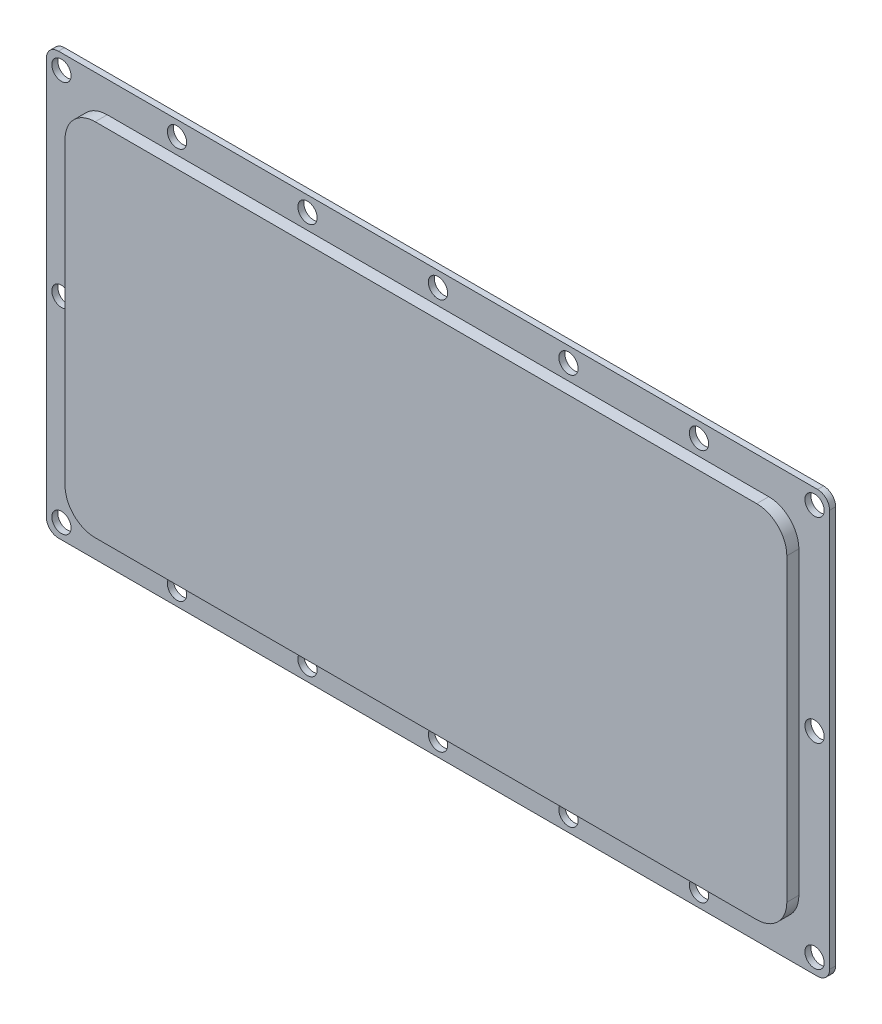
ISO-10303-21;
HEADER;
FILE_DESCRIPTION(('STEP AP214'),'2;1');
FILE_NAME('part.step','',(''),(''),'','','');
FILE_SCHEMA(('AUTOMOTIVE_DESIGN { 1 0 10303 214 1 1 1 1 }'));
ENDSEC;
DATA;
#1=APPLICATION_CONTEXT('core data for automotive mechanical design processes');
#2=APPLICATION_PROTOCOL_DEFINITION('international standard','automotive_design',2000,#1);
#3=PRODUCT_CONTEXT('',#1,'mechanical');
#4=PRODUCT('Part','Part','',(#3));
#5=PRODUCT_RELATED_PRODUCT_CATEGORY('part','',(#4));
#6=PRODUCT_DEFINITION_FORMATION('','',#4);
#7=PRODUCT_DEFINITION_CONTEXT('part definition',#1,'design');
#8=PRODUCT_DEFINITION('design','',#6,#7);
#9=PRODUCT_DEFINITION_SHAPE('','',#8);
#10=(LENGTH_UNIT() NAMED_UNIT(*) SI_UNIT(.MILLI.,.METRE.));
#11=(NAMED_UNIT(*) PLANE_ANGLE_UNIT() SI_UNIT($,.RADIAN.));
#12=(NAMED_UNIT(*) SI_UNIT($,.STERADIAN.) SOLID_ANGLE_UNIT());
#13=UNCERTAINTY_MEASURE_WITH_UNIT(LENGTH_MEASURE(1.E-05),#10,'distance_accuracy_value','');
#14=(GEOMETRIC_REPRESENTATION_CONTEXT(3) GLOBAL_UNCERTAINTY_ASSIGNED_CONTEXT((#13)) GLOBAL_UNIT_ASSIGNED_CONTEXT((#10,
#11,#12)) REPRESENTATION_CONTEXT('',''));
#15=CARTESIAN_POINT('',(0.,0.,0.));
#16=DIRECTION('',(0.,0.,1.));
#17=DIRECTION('',(1.,0.,0.));
#18=AXIS2_PLACEMENT_3D('',#15,#16,#17);
#19=CARTESIAN_POINT('',(2.,2.,1.));
#20=DIRECTION('',(0.,0.,-1.));
#21=DIRECTION('',(-1.,0.,0.));
#22=AXIS2_PLACEMENT_3D('',#19,#20,#21);
#23=PLANE('',#22);
#24=CARTESIAN_POINT('',(21.68,67.5,1.));
#25=DIRECTION('',(0.,0.,-1.));
#26=DIRECTION('',(-1.,0.,0.));
#27=AXIS2_PLACEMENT_3D('',#24,#25,#26);
#28=CIRCLE('',#27,1.6);
#29=CARTESIAN_POINT('',(20.08,67.5,1.));
#30=VERTEX_POINT('',#29);
#31=EDGE_CURVE('E598',#30,#30,#28,.F.);
#32=ORIENTED_EDGE('',*,*,#31,.F.);
#33=EDGE_LOOP('',(#32));
#34=FACE_BOUND('',#33,.T.);
#35=CARTESIAN_POINT('',(2.5,67.5,1.));
#36=DIRECTION('',(0.,0.,-1.));
#37=DIRECTION('',(-1.,0.,0.));
#38=AXIS2_PLACEMENT_3D('',#35,#36,#37);
#39=CIRCLE('',#38,1.6);
#40=CARTESIAN_POINT('',(0.900000000000001,67.5,1.));
#41=VERTEX_POINT('',#40);
#42=EDGE_CURVE('E604',#41,#41,#39,.F.);
#43=ORIENTED_EDGE('',*,*,#42,.F.);
#44=EDGE_LOOP('',(#43));
#45=FACE_BOUND('',#44,.T.);
#46=CARTESIAN_POINT('',(2.49999999999999,2.5,1.));
#47=DIRECTION('',(0.,0.,-1.));
#48=DIRECTION('',(-1.,0.,0.));
#49=AXIS2_PLACEMENT_3D('',#46,#47,#48);
#50=CIRCLE('',#49,1.6);
#51=CARTESIAN_POINT('',(0.899999999999992,2.5,1.));
#52=VERTEX_POINT('',#51);
#53=EDGE_CURVE('E611',#52,#52,#50,.F.);
#54=ORIENTED_EDGE('',*,*,#53,.F.);
#55=EDGE_LOOP('',(#54));
#56=FACE_BOUND('',#55,.T.);
#57=CARTESIAN_POINT('',(21.68,2.5,1.));
#58=DIRECTION('',(0.,0.,-1.));
#59=DIRECTION('',(-1.,0.,0.));
#60=AXIS2_PLACEMENT_3D('',#57,#58,#59);
#61=CIRCLE('',#60,1.6);
#62=CARTESIAN_POINT('',(20.08,2.5,1.));
#63=VERTEX_POINT('',#62);
#64=EDGE_CURVE('E617',#63,#63,#61,.F.);
#65=ORIENTED_EDGE('',*,*,#64,.F.);
#66=EDGE_LOOP('',(#65));
#67=FACE_BOUND('',#66,.T.);
#68=CARTESIAN_POINT('',(86.66,2.49999999999999,1.));
#69=DIRECTION('',(0.,0.,-1.));
#70=DIRECTION('',(-1.,0.,0.));
#71=AXIS2_PLACEMENT_3D('',#68,#69,#70);
#72=CIRCLE('',#71,1.60000000000001);
#73=CARTESIAN_POINT('',(85.06,2.49999999999999,1.));
#74=VERTEX_POINT('',#73);
#75=EDGE_CURVE('E630',#74,#74,#72,.F.);
#76=ORIENTED_EDGE('',*,*,#75,.F.);
#77=EDGE_LOOP('',(#76));
#78=FACE_BOUND('',#77,.T.);
#79=CARTESIAN_POINT('',(65.,2.49999999999999,1.));
#80=DIRECTION('',(0.,0.,-1.));
#81=DIRECTION('',(-1.,0.,0.));
#82=AXIS2_PLACEMENT_3D('',#79,#80,#81);
#83=CIRCLE('',#82,1.60000000000001);
#84=CARTESIAN_POINT('',(63.4,2.49999999999999,1.));
#85=VERTEX_POINT('',#84);
#86=EDGE_CURVE('E629',#85,#85,#83,.F.);
#87=ORIENTED_EDGE('',*,*,#86,.F.);
#88=EDGE_LOOP('',(#87));
#89=FACE_BOUND('',#88,.T.);
#90=CARTESIAN_POINT('',(43.34,2.5,1.));
#91=DIRECTION('',(0.,0.,-1.));
#92=DIRECTION('',(-1.,0.,0.));
#93=AXIS2_PLACEMENT_3D('',#90,#91,#92);
#94=CIRCLE('',#93,1.6);
#95=CARTESIAN_POINT('',(41.74,2.5,1.));
#96=VERTEX_POINT('',#95);
#97=EDGE_CURVE('E643',#96,#96,#94,.F.);
#98=ORIENTED_EDGE('',*,*,#97,.F.);
#99=EDGE_LOOP('',(#98));
#100=FACE_BOUND('',#99,.T.);
#101=CARTESIAN_POINT('',(65.,67.5,1.));
#102=DIRECTION('',(0.,0.,-1.));
#103=DIRECTION('',(-1.,0.,0.));
#104=AXIS2_PLACEMENT_3D('',#101,#102,#103);
#105=CIRCLE('',#104,1.60000000000001);
#106=CARTESIAN_POINT('',(63.4,67.5,1.));
#107=VERTEX_POINT('',#106);
#108=EDGE_CURVE('E623',#107,#107,#105,.F.);
#109=ORIENTED_EDGE('',*,*,#108,.F.);
#110=EDGE_LOOP('',(#109));
#111=FACE_BOUND('',#110,.T.);
#112=CARTESIAN_POINT('',(127.5,35.,1.));
#113=DIRECTION('',(0.,0.,-1.));
#114=DIRECTION('',(-1.,0.,0.));
#115=AXIS2_PLACEMENT_3D('',#112,#113,#114);
#116=CIRCLE('',#115,1.59999999999999);
#117=CARTESIAN_POINT('',(125.9,35.,1.));
#118=VERTEX_POINT('',#117);
#119=EDGE_CURVE('E715',#118,#118,#116,.F.);
#120=ORIENTED_EDGE('',*,*,#119,.F.);
#121=EDGE_LOOP('',(#120));
#122=FACE_BOUND('',#121,.T.);
#123=CARTESIAN_POINT('',(2.5,35.,1.));
#124=DIRECTION('',(0.,0.,-1.));
#125=DIRECTION('',(-1.,0.,0.));
#126=AXIS2_PLACEMENT_3D('',#123,#124,#125);
#127=CIRCLE('',#126,1.6);
#128=CARTESIAN_POINT('',(0.899999999999998,35.,1.));
#129=VERTEX_POINT('',#128);
#130=EDGE_CURVE('E719',#129,#129,#127,.F.);
#131=ORIENTED_EDGE('',*,*,#130,.F.);
#132=EDGE_LOOP('',(#131));
#133=FACE_BOUND('',#132,.T.);
#134=CARTESIAN_POINT('',(86.66,67.5,1.));
#135=DIRECTION('',(0.,0.,-1.));
#136=DIRECTION('',(-1.,0.,0.));
#137=AXIS2_PLACEMENT_3D('',#134,#135,#136);
#138=CIRCLE('',#137,1.60000000000001);
#139=CARTESIAN_POINT('',(85.06,67.5,1.));
#140=VERTEX_POINT('',#139);
#141=EDGE_CURVE('E723',#140,#140,#138,.F.);
#142=ORIENTED_EDGE('',*,*,#141,.F.);
#143=EDGE_LOOP('',(#142));
#144=FACE_BOUND('',#143,.T.);
#145=CARTESIAN_POINT('',(108.32,67.5,1.));
#146=DIRECTION('',(0.,0.,-1.));
#147=DIRECTION('',(-1.,0.,0.));
#148=AXIS2_PLACEMENT_3D('',#145,#146,#147);
#149=CIRCLE('',#148,1.60000000000001);
#150=CARTESIAN_POINT('',(106.72,67.5,1.));
#151=VERTEX_POINT('',#150);
#152=EDGE_CURVE('E727',#151,#151,#149,.F.);
#153=ORIENTED_EDGE('',*,*,#152,.F.);
#154=EDGE_LOOP('',(#153));
#155=FACE_BOUND('',#154,.T.);
#156=CARTESIAN_POINT('',(127.5,67.5,1.));
#157=DIRECTION('',(0.,0.,-1.));
#158=DIRECTION('',(-1.,0.,0.));
#159=AXIS2_PLACEMENT_3D('',#156,#157,#158);
#160=CIRCLE('',#159,1.59999999999999);
#161=CARTESIAN_POINT('',(125.9,67.5,1.));
#162=VERTEX_POINT('',#161);
#163=EDGE_CURVE('E731',#162,#162,#160,.F.);
#164=ORIENTED_EDGE('',*,*,#163,.F.);
#165=EDGE_LOOP('',(#164));
#166=FACE_BOUND('',#165,.T.);
#167=CARTESIAN_POINT('',(127.5,2.49999999999998,1.));
#168=DIRECTION('',(0.,0.,-1.));
#169=DIRECTION('',(-1.,0.,0.));
#170=AXIS2_PLACEMENT_3D('',#167,#168,#169);
#171=CIRCLE('',#170,1.59999999999999);
#172=CARTESIAN_POINT('',(125.9,2.49999999999998,1.));
#173=VERTEX_POINT('',#172);
#174=EDGE_CURVE('E735',#173,#173,#171,.F.);
#175=ORIENTED_EDGE('',*,*,#174,.F.);
#176=EDGE_LOOP('',(#175));
#177=FACE_BOUND('',#176,.T.);
#178=CARTESIAN_POINT('',(108.32,2.49999999999999,1.));
#179=DIRECTION('',(0.,0.,-1.));
#180=DIRECTION('',(-1.,0.,0.));
#181=AXIS2_PLACEMENT_3D('',#178,#179,#180);
#182=CIRCLE('',#181,1.60000000000001);
#183=CARTESIAN_POINT('',(106.72,2.49999999999999,1.));
#184=VERTEX_POINT('',#183);
#185=EDGE_CURVE('E637',#184,#184,#182,.F.);
#186=ORIENTED_EDGE('',*,*,#185,.F.);
#187=EDGE_LOOP('',(#186));
#188=FACE_BOUND('',#187,.T.);
#189=CARTESIAN_POINT('',(43.34,67.5,1.));
#190=DIRECTION('',(0.,0.,-1.));
#191=DIRECTION('',(-1.,0.,0.));
#192=AXIS2_PLACEMENT_3D('',#189,#190,#191);
#193=CIRCLE('',#192,1.6);
#194=CARTESIAN_POINT('',(41.74,67.5,1.));
#195=VERTEX_POINT('',#194);
#196=EDGE_CURVE('E602',#195,#195,#193,.F.);
#197=ORIENTED_EDGE('',*,*,#196,.F.);
#198=EDGE_LOOP('',(#197));
#199=FACE_BOUND('',#198,.T.);
#200=CARTESIAN_POINT('',(2.,2.,1.));
#201=DIRECTION('',(0.,0.,1.));
#202=DIRECTION('',(-1.,0.,0.));
#203=AXIS2_PLACEMENT_3D('',#200,#201,#202);
#204=CIRCLE('',#203,2.);
#205=CARTESIAN_POINT('',(0.,2.00000000000001,1.));
#206=VERTEX_POINT('',#205);
#207=CARTESIAN_POINT('',(2.00000000000001,0.,1.));
#208=VERTEX_POINT('',#207);
#209=EDGE_CURVE('E179',#206,#208,#204,.T.);
#210=ORIENTED_EDGE('',*,*,#209,.T.);
#211=DIRECTION('',(1.,0.,0.));
#212=VECTOR('',#211,1.);
#213=CARTESIAN_POINT('',(2.00000000000001,0.,1.));
#214=LINE('',#213,#212);
#215=CARTESIAN_POINT('',(128.,0.,1.));
#216=VERTEX_POINT('',#215);
#217=EDGE_CURVE('E182',#208,#216,#214,.T.);
#218=ORIENTED_EDGE('',*,*,#217,.T.);
#219=CARTESIAN_POINT('',(128.,2.,1.));
#220=DIRECTION('',(0.,0.,1.));
#221=DIRECTION('',(1.,0.,0.));
#222=AXIS2_PLACEMENT_3D('',#219,#220,#221);
#223=CIRCLE('',#222,2.);
#224=CARTESIAN_POINT('',(130.,2.,1.));
#225=VERTEX_POINT('',#224);
#226=EDGE_CURVE('E185',#216,#225,#223,.T.);
#227=ORIENTED_EDGE('',*,*,#226,.T.);
#228=DIRECTION('',(0.,1.,0.));
#229=VECTOR('',#228,1.);
#230=CARTESIAN_POINT('',(130.,2.00000000000001,1.));
#231=LINE('',#230,#229);
#232=CARTESIAN_POINT('',(130.,68.,1.));
#233=VERTEX_POINT('',#232);
#234=EDGE_CURVE('E187',#225,#233,#231,.T.);
#235=ORIENTED_EDGE('',*,*,#234,.T.);
#236=CARTESIAN_POINT('',(128.,68.,1.));
#237=DIRECTION('',(0.,0.,1.));
#238=DIRECTION('',(-1.,0.,0.));
#239=AXIS2_PLACEMENT_3D('',#236,#237,#238);
#240=CIRCLE('',#239,2.);
#241=CARTESIAN_POINT('',(128.,70.,1.));
#242=VERTEX_POINT('',#241);
#243=EDGE_CURVE('E189',#233,#242,#240,.T.);
#244=ORIENTED_EDGE('',*,*,#243,.T.);
#245=DIRECTION('',(-1.,0.,0.));
#246=VECTOR('',#245,1.);
#247=CARTESIAN_POINT('',(2.00000000000001,70.,1.));
#248=LINE('',#247,#246);
#249=CARTESIAN_POINT('',(2.00000000000001,70.,1.));
#250=VERTEX_POINT('',#249);
#251=EDGE_CURVE('E191',#242,#250,#248,.T.);
#252=ORIENTED_EDGE('',*,*,#251,.T.);
#253=CARTESIAN_POINT('',(2.,68.,1.));
#254=DIRECTION('',(0.,0.,1.));
#255=DIRECTION('',(-1.,0.,0.));
#256=AXIS2_PLACEMENT_3D('',#253,#254,#255);
#257=CIRCLE('',#256,2.);
#258=CARTESIAN_POINT('',(0.,68.,1.));
#259=VERTEX_POINT('',#258);
#260=EDGE_CURVE('E193',#250,#259,#257,.T.);
#261=ORIENTED_EDGE('',*,*,#260,.T.);
#262=DIRECTION('',(0.,-1.,0.));
#263=VECTOR('',#262,1.);
#264=CARTESIAN_POINT('',(0.,2.00000000000001,1.));
#265=LINE('',#264,#263);
#266=EDGE_CURVE('E195',#259,#206,#265,.T.);
#267=ORIENTED_EDGE('',*,*,#266,.T.);
#268=EDGE_LOOP('',(#210,#218,#227,#235,#244,#252,#261,#267));
#269=FACE_BOUND('',#268,.T.);
#270=CARTESIAN_POINT('',(119.9,59.9,1.));
#271=DIRECTION('',(0.,0.,1.));
#272=DIRECTION('',(-1.,0.,0.));
#273=AXIS2_PLACEMENT_3D('',#270,#271,#272);
#274=CIRCLE('',#273,5.);
#275=CARTESIAN_POINT('',(124.9,59.9,1.));
#276=VERTEX_POINT('',#275);
#277=CARTESIAN_POINT('',(119.9,64.9,1.));
#278=VERTEX_POINT('',#277);
#279=EDGE_CURVE('E52',#276,#278,#274,.T.);
#280=ORIENTED_EDGE('',*,*,#279,.F.);
#281=DIRECTION('',(0.,1.,0.));
#282=VECTOR('',#281,1.);
#283=CARTESIAN_POINT('',(124.9,59.9,1.));
#284=LINE('',#283,#282);
#285=CARTESIAN_POINT('',(124.9,10.1,1.));
#286=VERTEX_POINT('',#285);
#287=EDGE_CURVE('E56',#286,#276,#284,.T.);
#288=ORIENTED_EDGE('',*,*,#287,.F.);
#289=CARTESIAN_POINT('',(119.9,10.1,1.));
#290=DIRECTION('',(0.,0.,1.));
#291=DIRECTION('',(1.,0.,0.));
#292=AXIS2_PLACEMENT_3D('',#289,#290,#291);
#293=CIRCLE('',#292,5.);
#294=CARTESIAN_POINT('',(119.9,5.1,1.));
#295=VERTEX_POINT('',#294);
#296=EDGE_CURVE('E678',#295,#286,#293,.T.);
#297=ORIENTED_EDGE('',*,*,#296,.F.);
#298=DIRECTION('',(1.,0.,0.));
#299=VECTOR('',#298,1.);
#300=CARTESIAN_POINT('',(10.1,5.1,1.));
#301=LINE('',#300,#299);
#302=CARTESIAN_POINT('',(10.1,5.1,1.));
#303=VERTEX_POINT('',#302);
#304=EDGE_CURVE('E675',#303,#295,#301,.T.);
#305=ORIENTED_EDGE('',*,*,#304,.F.);
#306=CARTESIAN_POINT('',(10.1,10.1,1.));
#307=DIRECTION('',(0.,0.,1.));
#308=DIRECTION('',(1.,0.,0.));
#309=AXIS2_PLACEMENT_3D('',#306,#307,#308);
#310=CIRCLE('',#309,5.);
#311=CARTESIAN_POINT('',(5.1,10.1,1.));
#312=VERTEX_POINT('',#311);
#313=EDGE_CURVE('E672',#312,#303,#310,.T.);
#314=ORIENTED_EDGE('',*,*,#313,.F.);
#315=DIRECTION('',(0.,-1.,0.));
#316=VECTOR('',#315,1.);
#317=CARTESIAN_POINT('',(5.1,59.9,1.));
#318=LINE('',#317,#316);
#319=CARTESIAN_POINT('',(5.1,59.9,1.));
#320=VERTEX_POINT('',#319);
#321=EDGE_CURVE('E669',#320,#312,#318,.T.);
#322=ORIENTED_EDGE('',*,*,#321,.F.);
#323=CARTESIAN_POINT('',(10.1,59.9,1.));
#324=DIRECTION('',(0.,0.,1.));
#325=DIRECTION('',(1.,0.,0.));
#326=AXIS2_PLACEMENT_3D('',#323,#324,#325);
#327=CIRCLE('',#326,5.);
#328=CARTESIAN_POINT('',(10.1,64.9,1.));
#329=VERTEX_POINT('',#328);
#330=EDGE_CURVE('E666',#329,#320,#327,.T.);
#331=ORIENTED_EDGE('',*,*,#330,.F.);
#332=DIRECTION('',(-1.,0.,0.));
#333=VECTOR('',#332,1.);
#334=CARTESIAN_POINT('',(10.1,64.9,1.));
#335=LINE('',#334,#333);
#336=EDGE_CURVE('E664',#278,#329,#335,.T.);
#337=ORIENTED_EDGE('',*,*,#336,.F.);
#338=EDGE_LOOP('',(#280,#288,#297,#305,#314,#322,#331,#337));
#339=FACE_BOUND('',#338,.T.);
#340=ADVANCED_FACE('F37',(#34,#45,#56,#67,#78,#89,#100,#111,#122,#133,#144,#155,#166,#177,#188,
#199,#269,#339),#23,.F.);
#341=CARTESIAN_POINT('',(2.,2.,1.));
#342=DIRECTION('',(0.,0.,-1.));
#343=DIRECTION('',(-1.,0.,0.));
#344=AXIS2_PLACEMENT_3D('',#341,#342,#343);
#345=CYLINDRICAL_SURFACE('',#344,2.);
#346=CARTESIAN_POINT('',(2.,2.,0.));
#347=DIRECTION('',(0.,0.,1.));
#348=DIRECTION('',(-1.,0.,0.));
#349=AXIS2_PLACEMENT_3D('',#346,#347,#348);
#350=CIRCLE('',#349,2.);
#351=CARTESIAN_POINT('',(0.,2.00000000000001,0.));
#352=VERTEX_POINT('',#351);
#353=CARTESIAN_POINT('',(2.00000000000001,0.,0.));
#354=VERTEX_POINT('',#353);
#355=EDGE_CURVE('E170',#352,#354,#350,.T.);
#356=ORIENTED_EDGE('',*,*,#355,.T.);
#357=DIRECTION('',(0.,0.,-1.));
#358=VECTOR('',#357,1.);
#359=CARTESIAN_POINT('',(2.00000000000001,0.,1.));
#360=LINE('',#359,#358);
#361=EDGE_CURVE('E11',#208,#354,#360,.T.);
#362=ORIENTED_EDGE('',*,*,#361,.F.);
#363=ORIENTED_EDGE('',*,*,#209,.F.);
#364=DIRECTION('',(0.,0.,-1.));
#365=VECTOR('',#364,1.);
#366=CARTESIAN_POINT('',(0.,2.00000000000001,1.));
#367=LINE('',#366,#365);
#368=EDGE_CURVE('E196',#206,#352,#367,.T.);
#369=ORIENTED_EDGE('',*,*,#368,.T.);
#370=EDGE_LOOP('',(#356,#362,#363,#369));
#371=FACE_BOUND('',#370,.T.);
#372=ADVANCED_FACE('F39',(#371),#345,.T.);
#373=CARTESIAN_POINT('',(2.00000000000001,0.,1.));
#374=DIRECTION('',(0.,1.,0.));
#375=DIRECTION('',(0.,0.,1.));
#376=AXIS2_PLACEMENT_3D('',#373,#374,#375);
#377=PLANE('',#376);
#378=DIRECTION('',(1.,0.,0.));
#379=VECTOR('',#378,1.);
#380=CARTESIAN_POINT('',(2.00000000000001,0.,0.));
#381=LINE('',#380,#379);
#382=CARTESIAN_POINT('',(128.,0.,0.));
#383=VERTEX_POINT('',#382);
#384=EDGE_CURVE('E173',#354,#383,#381,.T.);
#385=ORIENTED_EDGE('',*,*,#384,.T.);
#386=DIRECTION('',(0.,0.,-1.));
#387=VECTOR('',#386,1.);
#388=CARTESIAN_POINT('',(128.,0.,1.));
#389=LINE('',#388,#387);
#390=EDGE_CURVE('E45',#216,#383,#389,.T.);
#391=ORIENTED_EDGE('',*,*,#390,.F.);
#392=ORIENTED_EDGE('',*,*,#217,.F.);
#393=ORIENTED_EDGE('',*,*,#361,.T.);
#394=EDGE_LOOP('',(#385,#391,#392,#393));
#395=FACE_BOUND('',#394,.T.);
#396=ADVANCED_FACE('F253',(#395),#377,.F.);
#397=CARTESIAN_POINT('',(128.,2.,1.));
#398=DIRECTION('',(0.,0.,-1.));
#399=DIRECTION('',(-1.,0.,0.));
#400=AXIS2_PLACEMENT_3D('',#397,#398,#399);
#401=CYLINDRICAL_SURFACE('',#400,2.);
#402=CARTESIAN_POINT('',(128.,2.,0.));
#403=DIRECTION('',(0.,0.,1.));
#404=DIRECTION('',(1.,0.,0.));
#405=AXIS2_PLACEMENT_3D('',#402,#403,#404);
#406=CIRCLE('',#405,2.);
#407=CARTESIAN_POINT('',(130.,2.,0.));
#408=VERTEX_POINT('',#407);
#409=EDGE_CURVE('E199',#383,#408,#406,.T.);
#410=ORIENTED_EDGE('',*,*,#409,.T.);
#411=DIRECTION('',(0.,0.,-1.));
#412=VECTOR('',#411,1.);
#413=CARTESIAN_POINT('',(130.,2.,1.));
#414=LINE('',#413,#412);
#415=EDGE_CURVE('E224',#225,#408,#414,.T.);
#416=ORIENTED_EDGE('',*,*,#415,.F.);
#417=ORIENTED_EDGE('',*,*,#226,.F.);
#418=ORIENTED_EDGE('',*,*,#390,.T.);
#419=EDGE_LOOP('',(#410,#416,#417,#418));
#420=FACE_BOUND('',#419,.T.);
#421=ADVANCED_FACE('F231',(#420),#401,.T.);
#422=CARTESIAN_POINT('',(130.,2.00000000000001,1.));
#423=DIRECTION('',(-1.,0.,0.));
#424=DIRECTION('',(0.,0.,1.));
#425=AXIS2_PLACEMENT_3D('',#422,#423,#424);
#426=PLANE('',#425);
#427=DIRECTION('',(0.,1.,0.));
#428=VECTOR('',#427,1.);
#429=CARTESIAN_POINT('',(130.,2.00000000000001,0.));
#430=LINE('',#429,#428);
#431=CARTESIAN_POINT('',(130.,68.,0.));
#432=VERTEX_POINT('',#431);
#433=EDGE_CURVE('E201',#408,#432,#430,.T.);
#434=ORIENTED_EDGE('',*,*,#433,.T.);
#435=DIRECTION('',(0.,0.,-1.));
#436=VECTOR('',#435,1.);
#437=CARTESIAN_POINT('',(130.,68.,1.));
#438=LINE('',#437,#436);
#439=EDGE_CURVE('E221',#233,#432,#438,.T.);
#440=ORIENTED_EDGE('',*,*,#439,.F.);
#441=ORIENTED_EDGE('',*,*,#234,.F.);
#442=ORIENTED_EDGE('',*,*,#415,.T.);
#443=EDGE_LOOP('',(#434,#440,#441,#442));
#444=FACE_BOUND('',#443,.T.);
#445=ADVANCED_FACE('F242',(#444),#426,.F.);
#446=CARTESIAN_POINT('',(128.,68.,1.));
#447=DIRECTION('',(0.,0.,-1.));
#448=DIRECTION('',(-1.,0.,0.));
#449=AXIS2_PLACEMENT_3D('',#446,#447,#448);
#450=CYLINDRICAL_SURFACE('',#449,2.);
#451=CARTESIAN_POINT('',(128.,68.,0.));
#452=DIRECTION('',(0.,0.,1.));
#453=DIRECTION('',(-1.,0.,0.));
#454=AXIS2_PLACEMENT_3D('',#451,#452,#453);
#455=CIRCLE('',#454,2.);
#456=CARTESIAN_POINT('',(128.,70.,0.));
#457=VERTEX_POINT('',#456);
#458=EDGE_CURVE('E203',#432,#457,#455,.T.);
#459=ORIENTED_EDGE('',*,*,#458,.T.);
#460=DIRECTION('',(0.,0.,-1.));
#461=VECTOR('',#460,1.);
#462=CARTESIAN_POINT('',(128.,70.,1.));
#463=LINE('',#462,#461);
#464=EDGE_CURVE('E218',#242,#457,#463,.T.);
#465=ORIENTED_EDGE('',*,*,#464,.F.);
#466=ORIENTED_EDGE('',*,*,#243,.F.);
#467=ORIENTED_EDGE('',*,*,#439,.T.);
#468=EDGE_LOOP('',(#459,#465,#466,#467));
#469=FACE_BOUND('',#468,.T.);
#470=ADVANCED_FACE('F246',(#469),#450,.T.);
#471=CARTESIAN_POINT('',(2.00000000000001,70.,1.));
#472=DIRECTION('',(0.,-1.,0.));
#473=DIRECTION('',(0.,0.,-1.));
#474=AXIS2_PLACEMENT_3D('',#471,#472,#473);
#475=PLANE('',#474);
#476=DIRECTION('',(-1.,0.,0.));
#477=VECTOR('',#476,1.);
#478=CARTESIAN_POINT('',(2.00000000000001,70.,0.));
#479=LINE('',#478,#477);
#480=CARTESIAN_POINT('',(2.00000000000001,70.,0.));
#481=VERTEX_POINT('',#480);
#482=EDGE_CURVE('E205',#457,#481,#479,.T.);
#483=ORIENTED_EDGE('',*,*,#482,.T.);
#484=DIRECTION('',(0.,0.,-1.));
#485=VECTOR('',#484,1.);
#486=CARTESIAN_POINT('',(2.00000000000001,70.,1.));
#487=LINE('',#486,#485);
#488=EDGE_CURVE('E215',#250,#481,#487,.T.);
#489=ORIENTED_EDGE('',*,*,#488,.F.);
#490=ORIENTED_EDGE('',*,*,#251,.F.);
#491=ORIENTED_EDGE('',*,*,#464,.T.);
#492=EDGE_LOOP('',(#483,#489,#490,#491));
#493=FACE_BOUND('',#492,.T.);
#494=ADVANCED_FACE('F266',(#493),#475,.F.);
#495=CARTESIAN_POINT('',(2.,68.,1.));
#496=DIRECTION('',(0.,0.,-1.));
#497=DIRECTION('',(-1.,0.,0.));
#498=AXIS2_PLACEMENT_3D('',#495,#496,#497);
#499=CYLINDRICAL_SURFACE('',#498,2.);
#500=CARTESIAN_POINT('',(2.,68.,0.));
#501=DIRECTION('',(0.,0.,1.));
#502=DIRECTION('',(-1.,0.,0.));
#503=AXIS2_PLACEMENT_3D('',#500,#501,#502);
#504=CIRCLE('',#503,2.);
#505=CARTESIAN_POINT('',(0.,68.,0.));
#506=VERTEX_POINT('',#505);
#507=EDGE_CURVE('E207',#481,#506,#504,.T.);
#508=ORIENTED_EDGE('',*,*,#507,.T.);
#509=DIRECTION('',(0.,0.,-1.));
#510=VECTOR('',#509,1.);
#511=CARTESIAN_POINT('',(0.,68.,1.));
#512=LINE('',#511,#510);
#513=EDGE_CURVE('E212',#259,#506,#512,.T.);
#514=ORIENTED_EDGE('',*,*,#513,.F.);
#515=ORIENTED_EDGE('',*,*,#260,.F.);
#516=ORIENTED_EDGE('',*,*,#488,.T.);
#517=EDGE_LOOP('',(#508,#514,#515,#516));
#518=FACE_BOUND('',#517,.T.);
#519=ADVANCED_FACE('F264',(#518),#499,.T.);
#520=CARTESIAN_POINT('',(0.,2.00000000000001,1.));
#521=DIRECTION('',(1.,0.,0.));
#522=DIRECTION('',(0.,0.,-1.));
#523=AXIS2_PLACEMENT_3D('',#520,#521,#522);
#524=PLANE('',#523);
#525=DIRECTION('',(0.,-1.,0.));
#526=VECTOR('',#525,1.);
#527=CARTESIAN_POINT('',(0.,2.00000000000001,0.));
#528=LINE('',#527,#526);
#529=EDGE_CURVE('E183',#506,#352,#528,.T.);
#530=ORIENTED_EDGE('',*,*,#529,.T.);
#531=ORIENTED_EDGE('',*,*,#368,.F.);
#532=ORIENTED_EDGE('',*,*,#266,.F.);
#533=ORIENTED_EDGE('',*,*,#513,.T.);
#534=EDGE_LOOP('',(#530,#531,#532,#533));
#535=FACE_BOUND('',#534,.T.);
#536=ADVANCED_FACE('F259',(#535),#524,.F.);
#537=CARTESIAN_POINT('',(2.,2.,0.));
#538=DIRECTION('',(0.,0.,-1.));
#539=DIRECTION('',(-1.,0.,0.));
#540=AXIS2_PLACEMENT_3D('',#537,#538,#539);
#541=PLANE('',#540);
#542=CARTESIAN_POINT('',(21.68,67.5,0.));
#543=DIRECTION('',(0.,0.,-1.));
#544=DIRECTION('',(-1.,0.,0.));
#545=AXIS2_PLACEMENT_3D('',#542,#543,#544);
#546=CIRCLE('',#545,1.6);
#547=CARTESIAN_POINT('',(20.08,67.5,0.));
#548=VERTEX_POINT('',#547);
#549=EDGE_CURVE('E596',#548,#548,#546,.T.);
#550=ORIENTED_EDGE('',*,*,#549,.F.);
#551=EDGE_LOOP('',(#550));
#552=FACE_BOUND('',#551,.T.);
#553=CARTESIAN_POINT('',(2.5,67.5,0.));
#554=DIRECTION('',(0.,0.,-1.));
#555=DIRECTION('',(-1.,0.,0.));
#556=AXIS2_PLACEMENT_3D('',#553,#554,#555);
#557=CIRCLE('',#556,1.6);
#558=CARTESIAN_POINT('',(0.900000000000001,67.5,0.));
#559=VERTEX_POINT('',#558);
#560=EDGE_CURVE('E608',#559,#559,#557,.T.);
#561=ORIENTED_EDGE('',*,*,#560,.F.);
#562=EDGE_LOOP('',(#561));
#563=FACE_BOUND('',#562,.T.);
#564=CARTESIAN_POINT('',(2.49999999999999,2.5,0.));
#565=DIRECTION('',(0.,0.,-1.));
#566=DIRECTION('',(-1.,0.,0.));
#567=AXIS2_PLACEMENT_3D('',#564,#565,#566);
#568=CIRCLE('',#567,1.6);
#569=CARTESIAN_POINT('',(0.899999999999992,2.5,0.));
#570=VERTEX_POINT('',#569);
#571=EDGE_CURVE('E614',#570,#570,#568,.T.);
#572=ORIENTED_EDGE('',*,*,#571,.F.);
#573=EDGE_LOOP('',(#572));
#574=FACE_BOUND('',#573,.T.);
#575=CARTESIAN_POINT('',(21.68,2.5,0.));
#576=DIRECTION('',(0.,0.,-1.));
#577=DIRECTION('',(-1.,0.,0.));
#578=AXIS2_PLACEMENT_3D('',#575,#576,#577);
#579=CIRCLE('',#578,1.6);
#580=CARTESIAN_POINT('',(20.08,2.5,0.));
#581=VERTEX_POINT('',#580);
#582=EDGE_CURVE('E620',#581,#581,#579,.T.);
#583=ORIENTED_EDGE('',*,*,#582,.F.);
#584=EDGE_LOOP('',(#583));
#585=FACE_BOUND('',#584,.T.);
#586=CARTESIAN_POINT('',(86.66,2.49999999999999,0.));
#587=DIRECTION('',(0.,0.,-1.));
#588=DIRECTION('',(-1.,0.,0.));
#589=AXIS2_PLACEMENT_3D('',#586,#587,#588);
#590=CIRCLE('',#589,1.60000000000001);
#591=CARTESIAN_POINT('',(85.06,2.49999999999999,0.));
#592=VERTEX_POINT('',#591);
#593=EDGE_CURVE('E634',#592,#592,#590,.T.);
#594=ORIENTED_EDGE('',*,*,#593,.F.);
#595=EDGE_LOOP('',(#594));
#596=FACE_BOUND('',#595,.T.);
#597=CARTESIAN_POINT('',(65.,2.49999999999999,0.));
#598=DIRECTION('',(0.,0.,-1.));
#599=DIRECTION('',(-1.,0.,0.));
#600=AXIS2_PLACEMENT_3D('',#597,#598,#599);
#601=CIRCLE('',#600,1.60000000000001);
#602=CARTESIAN_POINT('',(63.4,2.49999999999999,0.));
#603=VERTEX_POINT('',#602);
#604=EDGE_CURVE('E626',#603,#603,#601,.T.);
#605=ORIENTED_EDGE('',*,*,#604,.F.);
#606=EDGE_LOOP('',(#605));
#607=FACE_BOUND('',#606,.T.);
#608=CARTESIAN_POINT('',(43.34,2.5,0.));
#609=DIRECTION('',(0.,0.,-1.));
#610=DIRECTION('',(-1.,0.,0.));
#611=AXIS2_PLACEMENT_3D('',#608,#609,#610);
#612=CIRCLE('',#611,1.6);
#613=CARTESIAN_POINT('',(41.74,2.5,0.));
#614=VERTEX_POINT('',#613);
#615=EDGE_CURVE('E633',#614,#614,#612,.T.);
#616=ORIENTED_EDGE('',*,*,#615,.F.);
#617=EDGE_LOOP('',(#616));
#618=FACE_BOUND('',#617,.T.);
#619=CARTESIAN_POINT('',(65.,67.5,0.));
#620=DIRECTION('',(0.,0.,-1.));
#621=DIRECTION('',(-1.,0.,0.));
#622=AXIS2_PLACEMENT_3D('',#619,#620,#621);
#623=CIRCLE('',#622,1.60000000000001);
#624=CARTESIAN_POINT('',(63.4,67.5,0.));
#625=VERTEX_POINT('',#624);
#626=EDGE_CURVE('E640',#625,#625,#623,.T.);
#627=ORIENTED_EDGE('',*,*,#626,.F.);
#628=EDGE_LOOP('',(#627));
#629=FACE_BOUND('',#628,.T.);
#630=CARTESIAN_POINT('',(127.5,35.,0.));
#631=DIRECTION('',(0.,0.,-1.));
#632=DIRECTION('',(-1.,0.,0.));
#633=AXIS2_PLACEMENT_3D('',#630,#631,#632);
#634=CIRCLE('',#633,1.59999999999999);
#635=CARTESIAN_POINT('',(125.9,35.,0.));
#636=VERTEX_POINT('',#635);
#637=EDGE_CURVE('E767',#636,#636,#634,.T.);
#638=ORIENTED_EDGE('',*,*,#637,.F.);
#639=EDGE_LOOP('',(#638));
#640=FACE_BOUND('',#639,.T.);
#641=CARTESIAN_POINT('',(2.5,35.,0.));
#642=DIRECTION('',(0.,0.,-1.));
#643=DIRECTION('',(-1.,0.,0.));
#644=AXIS2_PLACEMENT_3D('',#641,#642,#643);
#645=CIRCLE('',#644,1.6);
#646=CARTESIAN_POINT('',(0.899999999999998,35.,0.));
#647=VERTEX_POINT('',#646);
#648=EDGE_CURVE('E763',#647,#647,#645,.T.);
#649=ORIENTED_EDGE('',*,*,#648,.F.);
#650=EDGE_LOOP('',(#649));
#651=FACE_BOUND('',#650,.T.);
#652=CARTESIAN_POINT('',(86.66,67.5,0.));
#653=DIRECTION('',(0.,0.,-1.));
#654=DIRECTION('',(-1.,0.,0.));
#655=AXIS2_PLACEMENT_3D('',#652,#653,#654);
#656=CIRCLE('',#655,1.60000000000001);
#657=CARTESIAN_POINT('',(85.06,67.5,0.));
#658=VERTEX_POINT('',#657);
#659=EDGE_CURVE('E757',#658,#658,#656,.T.);
#660=ORIENTED_EDGE('',*,*,#659,.F.);
#661=EDGE_LOOP('',(#660));
#662=FACE_BOUND('',#661,.T.);
#663=CARTESIAN_POINT('',(108.32,67.5,0.));
#664=DIRECTION('',(0.,0.,-1.));
#665=DIRECTION('',(-1.,0.,0.));
#666=AXIS2_PLACEMENT_3D('',#663,#664,#665);
#667=CIRCLE('',#666,1.60000000000001);
#668=CARTESIAN_POINT('',(106.72,67.5,0.));
#669=VERTEX_POINT('',#668);
#670=EDGE_CURVE('E753',#669,#669,#667,.T.);
#671=ORIENTED_EDGE('',*,*,#670,.F.);
#672=EDGE_LOOP('',(#671));
#673=FACE_BOUND('',#672,.T.);
#674=CARTESIAN_POINT('',(127.5,67.5,0.));
#675=DIRECTION('',(0.,0.,-1.));
#676=DIRECTION('',(-1.,0.,0.));
#677=AXIS2_PLACEMENT_3D('',#674,#675,#676);
#678=CIRCLE('',#677,1.59999999999999);
#679=CARTESIAN_POINT('',(125.9,67.5,0.));
#680=VERTEX_POINT('',#679);
#681=EDGE_CURVE('E749',#680,#680,#678,.T.);
#682=ORIENTED_EDGE('',*,*,#681,.F.);
#683=EDGE_LOOP('',(#682));
#684=FACE_BOUND('',#683,.T.);
#685=CARTESIAN_POINT('',(127.5,2.49999999999998,0.));
#686=DIRECTION('',(0.,0.,-1.));
#687=DIRECTION('',(-1.,0.,0.));
#688=AXIS2_PLACEMENT_3D('',#685,#686,#687);
#689=CIRCLE('',#688,1.59999999999999);
#690=CARTESIAN_POINT('',(125.9,2.49999999999998,0.));
#691=VERTEX_POINT('',#690);
#692=EDGE_CURVE('E745',#691,#691,#689,.T.);
#693=ORIENTED_EDGE('',*,*,#692,.F.);
#694=EDGE_LOOP('',(#693));
#695=FACE_BOUND('',#694,.T.);
#696=CARTESIAN_POINT('',(108.32,2.49999999999999,0.));
#697=DIRECTION('',(0.,0.,-1.));
#698=DIRECTION('',(-1.,0.,0.));
#699=AXIS2_PLACEMENT_3D('',#696,#697,#698);
#700=CIRCLE('',#699,1.60000000000001);
#701=CARTESIAN_POINT('',(106.72,2.49999999999999,0.));
#702=VERTEX_POINT('',#701);
#703=EDGE_CURVE('E739',#702,#702,#700,.T.);
#704=ORIENTED_EDGE('',*,*,#703,.F.);
#705=EDGE_LOOP('',(#704));
#706=FACE_BOUND('',#705,.T.);
#707=CARTESIAN_POINT('',(43.34,67.5,0.));
#708=DIRECTION('',(0.,0.,-1.));
#709=DIRECTION('',(-1.,0.,0.));
#710=AXIS2_PLACEMENT_3D('',#707,#708,#709);
#711=CIRCLE('',#710,1.6);
#712=CARTESIAN_POINT('',(41.74,67.5,0.));
#713=VERTEX_POINT('',#712);
#714=EDGE_CURVE('E599',#713,#713,#711,.T.);
#715=ORIENTED_EDGE('',*,*,#714,.F.);
#716=EDGE_LOOP('',(#715));
#717=FACE_BOUND('',#716,.T.);
#718=ORIENTED_EDGE('',*,*,#355,.F.);
#719=ORIENTED_EDGE('',*,*,#529,.F.);
#720=ORIENTED_EDGE('',*,*,#507,.F.);
#721=ORIENTED_EDGE('',*,*,#482,.F.);
#722=ORIENTED_EDGE('',*,*,#458,.F.);
#723=ORIENTED_EDGE('',*,*,#433,.F.);
#724=ORIENTED_EDGE('',*,*,#409,.F.);
#725=ORIENTED_EDGE('',*,*,#384,.F.);
#726=EDGE_LOOP('',(#718,#719,#720,#721,#722,#723,#724,#725));
#727=FACE_BOUND('',#726,.T.);
#728=ADVANCED_FACE('F237',(#552,#563,#574,#585,#596,#607,#618,#629,#640,#651,#662,#673,#684,
#695,#706,#717,#727),#541,.T.);
#729=CARTESIAN_POINT('',(119.9,59.9,3.));
#730=DIRECTION('',(0.,0.,-1.));
#731=DIRECTION('',(-1.,0.,0.));
#732=AXIS2_PLACEMENT_3D('',#729,#730,#731);
#733=CYLINDRICAL_SURFACE('',#732,5.);
#734=ORIENTED_EDGE('',*,*,#279,.T.);
#735=DIRECTION('',(0.,0.,-1.));
#736=VECTOR('',#735,1.);
#737=CARTESIAN_POINT('',(119.9,64.9,3.));
#738=LINE('',#737,#736);
#739=CARTESIAN_POINT('',(119.9,64.9,3.));
#740=VERTEX_POINT('',#739);
#741=EDGE_CURVE('E153',#740,#278,#738,.T.);
#742=ORIENTED_EDGE('',*,*,#741,.F.);
#743=CARTESIAN_POINT('',(119.9,59.9,3.));
#744=DIRECTION('',(0.,0.,1.));
#745=DIRECTION('',(-1.,0.,0.));
#746=AXIS2_PLACEMENT_3D('',#743,#744,#745);
#747=CIRCLE('',#746,5.);
#748=CARTESIAN_POINT('',(124.9,59.9,3.));
#749=VERTEX_POINT('',#748);
#750=EDGE_CURVE('E159',#749,#740,#747,.T.);
#751=ORIENTED_EDGE('',*,*,#750,.F.);
#752=DIRECTION('',(0.,0.,-1.));
#753=VECTOR('',#752,1.);
#754=CARTESIAN_POINT('',(124.9,59.9,3.));
#755=LINE('',#754,#753);
#756=EDGE_CURVE('E662',#749,#276,#755,.T.);
#757=ORIENTED_EDGE('',*,*,#756,.T.);
#758=EDGE_LOOP('',(#734,#742,#751,#757));
#759=FACE_BOUND('',#758,.T.);
#760=ADVANCED_FACE('F169',(#759),#733,.T.);
#761=CARTESIAN_POINT('',(10.1,64.9,3.));
#762=DIRECTION('',(0.,-1.,0.));
#763=DIRECTION('',(0.,0.,-1.));
#764=AXIS2_PLACEMENT_3D('',#761,#762,#763);
#765=PLANE('',#764);
#766=ORIENTED_EDGE('',*,*,#336,.T.);
#767=DIRECTION('',(0.,0.,-1.));
#768=VECTOR('',#767,1.);
#769=CARTESIAN_POINT('',(10.1,64.9,3.));
#770=LINE('',#769,#768);
#771=CARTESIAN_POINT('',(10.1,64.9,3.));
#772=VERTEX_POINT('',#771);
#773=EDGE_CURVE('E155',#772,#329,#770,.T.);
#774=ORIENTED_EDGE('',*,*,#773,.F.);
#775=DIRECTION('',(-1.,0.,0.));
#776=VECTOR('',#775,1.);
#777=CARTESIAN_POINT('',(10.1,64.9,3.));
#778=LINE('',#777,#776);
#779=EDGE_CURVE('E148',#740,#772,#778,.T.);
#780=ORIENTED_EDGE('',*,*,#779,.F.);
#781=ORIENTED_EDGE('',*,*,#741,.T.);
#782=EDGE_LOOP('',(#766,#774,#780,#781));
#783=FACE_BOUND('',#782,.T.);
#784=ADVANCED_FACE('F151',(#783),#765,.F.);
#785=CARTESIAN_POINT('',(10.1,59.9,3.));
#786=DIRECTION('',(0.,0.,-1.));
#787=DIRECTION('',(-1.,0.,0.));
#788=AXIS2_PLACEMENT_3D('',#785,#786,#787);
#789=CYLINDRICAL_SURFACE('',#788,5.);
#790=ORIENTED_EDGE('',*,*,#330,.T.);
#791=DIRECTION('',(0.,0.,-1.));
#792=VECTOR('',#791,1.);
#793=CARTESIAN_POINT('',(5.1,59.9,3.));
#794=LINE('',#793,#792);
#795=CARTESIAN_POINT('',(5.1,59.9,3.));
#796=VERTEX_POINT('',#795);
#797=EDGE_CURVE('E175',#796,#320,#794,.T.);
#798=ORIENTED_EDGE('',*,*,#797,.F.);
#799=CARTESIAN_POINT('',(10.1,59.9,3.));
#800=DIRECTION('',(0.,0.,1.));
#801=DIRECTION('',(1.,0.,0.));
#802=AXIS2_PLACEMENT_3D('',#799,#800,#801);
#803=CIRCLE('',#802,5.);
#804=EDGE_CURVE('E158',#772,#796,#803,.T.);
#805=ORIENTED_EDGE('',*,*,#804,.F.);
#806=ORIENTED_EDGE('',*,*,#773,.T.);
#807=EDGE_LOOP('',(#790,#798,#805,#806));
#808=FACE_BOUND('',#807,.T.);
#809=ADVANCED_FACE('F310',(#808),#789,.T.);
#810=CARTESIAN_POINT('',(5.1,59.9,3.));
#811=DIRECTION('',(1.,0.,0.));
#812=DIRECTION('',(0.,1.,0.));
#813=AXIS2_PLACEMENT_3D('',#810,#811,#812);
#814=PLANE('',#813);
#815=ORIENTED_EDGE('',*,*,#321,.T.);
#816=DIRECTION('',(0.,0.,-1.));
#817=VECTOR('',#816,1.);
#818=CARTESIAN_POINT('',(5.1,10.1,3.));
#819=LINE('',#818,#817);
#820=CARTESIAN_POINT('',(5.1,10.1,3.));
#821=VERTEX_POINT('',#820);
#822=EDGE_CURVE('E691',#821,#312,#819,.T.);
#823=ORIENTED_EDGE('',*,*,#822,.F.);
#824=DIRECTION('',(0.,-1.,0.));
#825=VECTOR('',#824,1.);
#826=CARTESIAN_POINT('',(5.1,59.9,3.));
#827=LINE('',#826,#825);
#828=EDGE_CURVE('E653',#796,#821,#827,.T.);
#829=ORIENTED_EDGE('',*,*,#828,.F.);
#830=ORIENTED_EDGE('',*,*,#797,.T.);
#831=EDGE_LOOP('',(#815,#823,#829,#830));
#832=FACE_BOUND('',#831,.T.);
#833=ADVANCED_FACE('F316',(#832),#814,.F.);
#834=CARTESIAN_POINT('',(10.1,10.1,3.));
#835=DIRECTION('',(0.,0.,-1.));
#836=DIRECTION('',(-1.,0.,0.));
#837=AXIS2_PLACEMENT_3D('',#834,#835,#836);
#838=CYLINDRICAL_SURFACE('',#837,5.);
#839=ORIENTED_EDGE('',*,*,#313,.T.);
#840=DIRECTION('',(0.,0.,-1.));
#841=VECTOR('',#840,1.);
#842=CARTESIAN_POINT('',(10.1,5.1,3.));
#843=LINE('',#842,#841);
#844=CARTESIAN_POINT('',(10.1,5.1,3.));
#845=VERTEX_POINT('',#844);
#846=EDGE_CURVE('E688',#845,#303,#843,.T.);
#847=ORIENTED_EDGE('',*,*,#846,.F.);
#848=CARTESIAN_POINT('',(10.1,10.1,3.));
#849=DIRECTION('',(0.,0.,1.));
#850=DIRECTION('',(1.,0.,0.));
#851=AXIS2_PLACEMENT_3D('',#848,#849,#850);
#852=CIRCLE('',#851,5.);
#853=EDGE_CURVE('E655',#821,#845,#852,.T.);
#854=ORIENTED_EDGE('',*,*,#853,.F.);
#855=ORIENTED_EDGE('',*,*,#822,.T.);
#856=EDGE_LOOP('',(#839,#847,#854,#855));
#857=FACE_BOUND('',#856,.T.);
#858=ADVANCED_FACE('F324',(#857),#838,.T.);
#859=CARTESIAN_POINT('',(10.1,5.1,3.));
#860=DIRECTION('',(0.,1.,0.));
#861=DIRECTION('',(0.,0.,1.));
#862=AXIS2_PLACEMENT_3D('',#859,#860,#861);
#863=PLANE('',#862);
#864=ORIENTED_EDGE('',*,*,#304,.T.);
#865=DIRECTION('',(0.,0.,-1.));
#866=VECTOR('',#865,1.);
#867=CARTESIAN_POINT('',(119.9,5.1,3.));
#868=LINE('',#867,#866);
#869=CARTESIAN_POINT('',(119.9,5.1,3.));
#870=VERTEX_POINT('',#869);
#871=EDGE_CURVE('E685',#870,#295,#868,.T.);
#872=ORIENTED_EDGE('',*,*,#871,.F.);
#873=DIRECTION('',(1.,0.,0.));
#874=VECTOR('',#873,1.);
#875=CARTESIAN_POINT('',(10.1,5.1,3.));
#876=LINE('',#875,#874);
#877=EDGE_CURVE('E657',#845,#870,#876,.T.);
#878=ORIENTED_EDGE('',*,*,#877,.F.);
#879=ORIENTED_EDGE('',*,*,#846,.T.);
#880=EDGE_LOOP('',(#864,#872,#878,#879));
#881=FACE_BOUND('',#880,.T.);
#882=ADVANCED_FACE('F332',(#881),#863,.F.);
#883=CARTESIAN_POINT('',(119.9,10.1,3.));
#884=DIRECTION('',(0.,0.,-1.));
#885=DIRECTION('',(-1.,0.,0.));
#886=AXIS2_PLACEMENT_3D('',#883,#884,#885);
#887=CYLINDRICAL_SURFACE('',#886,5.);
#888=ORIENTED_EDGE('',*,*,#296,.T.);
#889=DIRECTION('',(0.,0.,-1.));
#890=VECTOR('',#889,1.);
#891=CARTESIAN_POINT('',(124.9,10.1,3.));
#892=LINE('',#891,#890);
#893=CARTESIAN_POINT('',(124.9,10.1,3.));
#894=VERTEX_POINT('',#893);
#895=EDGE_CURVE('E682',#894,#286,#892,.T.);
#896=ORIENTED_EDGE('',*,*,#895,.F.);
#897=CARTESIAN_POINT('',(119.9,10.1,3.));
#898=DIRECTION('',(0.,0.,1.));
#899=DIRECTION('',(1.,0.,0.));
#900=AXIS2_PLACEMENT_3D('',#897,#898,#899);
#901=CIRCLE('',#900,5.);
#902=EDGE_CURVE('E659',#870,#894,#901,.T.);
#903=ORIENTED_EDGE('',*,*,#902,.F.);
#904=ORIENTED_EDGE('',*,*,#871,.T.);
#905=EDGE_LOOP('',(#888,#896,#903,#904));
#906=FACE_BOUND('',#905,.T.);
#907=ADVANCED_FACE('F340',(#906),#887,.T.);
#908=CARTESIAN_POINT('',(124.9,59.9,3.));
#909=DIRECTION('',(-1.,0.,0.));
#910=DIRECTION('',(0.,-1.,0.));
#911=AXIS2_PLACEMENT_3D('',#908,#909,#910);
#912=PLANE('',#911);
#913=ORIENTED_EDGE('',*,*,#287,.T.);
#914=ORIENTED_EDGE('',*,*,#756,.F.);
#915=DIRECTION('',(0.,1.,0.));
#916=VECTOR('',#915,1.);
#917=CARTESIAN_POINT('',(124.9,59.9,3.));
#918=LINE('',#917,#916);
#919=EDGE_CURVE('E164',#894,#749,#918,.T.);
#920=ORIENTED_EDGE('',*,*,#919,.F.);
#921=ORIENTED_EDGE('',*,*,#895,.T.);
#922=EDGE_LOOP('',(#913,#914,#920,#921));
#923=FACE_BOUND('',#922,.T.);
#924=ADVANCED_FACE('F348',(#923),#912,.F.);
#925=CARTESIAN_POINT('',(119.9,59.9,3.));
#926=DIRECTION('',(0.,0.,-1.));
#927=DIRECTION('',(-1.,0.,0.));
#928=AXIS2_PLACEMENT_3D('',#925,#926,#927);
#929=PLANE('',#928);
#930=ORIENTED_EDGE('',*,*,#750,.T.);
#931=ORIENTED_EDGE('',*,*,#779,.T.);
#932=ORIENTED_EDGE('',*,*,#804,.T.);
#933=ORIENTED_EDGE('',*,*,#828,.T.);
#934=ORIENTED_EDGE('',*,*,#853,.T.);
#935=ORIENTED_EDGE('',*,*,#877,.T.);
#936=ORIENTED_EDGE('',*,*,#902,.T.);
#937=ORIENTED_EDGE('',*,*,#919,.T.);
#938=EDGE_LOOP('',(#930,#931,#932,#933,#934,#935,#936,#937));
#939=FACE_BOUND('',#938,.T.);
#940=ADVANCED_FACE('F162',(#939),#929,.F.);
#941=CARTESIAN_POINT('',(43.34,67.5,3.001));
#942=DIRECTION('',(0.,0.,-1.));
#943=DIRECTION('',(-1.,0.,0.));
#944=AXIS2_PLACEMENT_3D('',#941,#942,#943);
#945=CYLINDRICAL_SURFACE('',#944,1.6);
#946=ORIENTED_EDGE('',*,*,#714,.T.);
#947=EDGE_LOOP('',(#946));
#948=FACE_BOUND('',#947,.T.);
#949=ORIENTED_EDGE('',*,*,#196,.T.);
#950=EDGE_LOOP('',(#949));
#951=FACE_BOUND('',#950,.T.);
#952=ADVANCED_FACE('F363',(#948,#951),#945,.F.);
#953=CARTESIAN_POINT('',(108.32,2.49999999999999,3.001));
#954=DIRECTION('',(0.,0.,-1.));
#955=DIRECTION('',(-1.,0.,0.));
#956=AXIS2_PLACEMENT_3D('',#953,#954,#955);
#957=CYLINDRICAL_SURFACE('',#956,1.60000000000001);
#958=ORIENTED_EDGE('',*,*,#703,.T.);
#959=EDGE_LOOP('',(#958));
#960=FACE_BOUND('',#959,.T.);
#961=ORIENTED_EDGE('',*,*,#185,.T.);
#962=EDGE_LOOP('',(#961));
#963=FACE_BOUND('',#962,.T.);
#964=ADVANCED_FACE('F369',(#960,#963),#957,.F.);
#965=CARTESIAN_POINT('',(127.5,2.49999999999998,3.001));
#966=DIRECTION('',(0.,0.,-1.));
#967=DIRECTION('',(-1.,0.,0.));
#968=AXIS2_PLACEMENT_3D('',#965,#966,#967);
#969=CYLINDRICAL_SURFACE('',#968,1.59999999999999);
#970=ORIENTED_EDGE('',*,*,#692,.T.);
#971=EDGE_LOOP('',(#970));
#972=FACE_BOUND('',#971,.T.);
#973=ORIENTED_EDGE('',*,*,#174,.T.);
#974=EDGE_LOOP('',(#973));
#975=FACE_BOUND('',#974,.T.);
#976=ADVANCED_FACE('F377',(#972,#975),#969,.F.);
#977=CARTESIAN_POINT('',(127.5,67.5,3.001));
#978=DIRECTION('',(0.,0.,-1.));
#979=DIRECTION('',(-1.,0.,0.));
#980=AXIS2_PLACEMENT_3D('',#977,#978,#979);
#981=CYLINDRICAL_SURFACE('',#980,1.59999999999999);
#982=ORIENTED_EDGE('',*,*,#681,.T.);
#983=EDGE_LOOP('',(#982));
#984=FACE_BOUND('',#983,.T.);
#985=ORIENTED_EDGE('',*,*,#163,.T.);
#986=EDGE_LOOP('',(#985));
#987=FACE_BOUND('',#986,.T.);
#988=ADVANCED_FACE('F385',(#984,#987),#981,.F.);
#989=CARTESIAN_POINT('',(108.32,67.5,3.001));
#990=DIRECTION('',(0.,0.,-1.));
#991=DIRECTION('',(-1.,0.,0.));
#992=AXIS2_PLACEMENT_3D('',#989,#990,#991);
#993=CYLINDRICAL_SURFACE('',#992,1.60000000000001);
#994=ORIENTED_EDGE('',*,*,#670,.T.);
#995=EDGE_LOOP('',(#994));
#996=FACE_BOUND('',#995,.T.);
#997=ORIENTED_EDGE('',*,*,#152,.T.);
#998=EDGE_LOOP('',(#997));
#999=FACE_BOUND('',#998,.T.);
#1000=ADVANCED_FACE('F393',(#996,#999),#993,.F.);
#1001=CARTESIAN_POINT('',(86.66,67.5,3.001));
#1002=DIRECTION('',(0.,0.,-1.));
#1003=DIRECTION('',(-1.,0.,0.));
#1004=AXIS2_PLACEMENT_3D('',#1001,#1002,#1003);
#1005=CYLINDRICAL_SURFACE('',#1004,1.60000000000001);
#1006=ORIENTED_EDGE('',*,*,#659,.T.);
#1007=EDGE_LOOP('',(#1006));
#1008=FACE_BOUND('',#1007,.T.);
#1009=ORIENTED_EDGE('',*,*,#141,.T.);
#1010=EDGE_LOOP('',(#1009));
#1011=FACE_BOUND('',#1010,.T.);
#1012=ADVANCED_FACE('F401',(#1008,#1011),#1005,.F.);
#1013=CARTESIAN_POINT('',(2.5,35.,3.001));
#1014=DIRECTION('',(0.,0.,-1.));
#1015=DIRECTION('',(-1.,0.,0.));
#1016=AXIS2_PLACEMENT_3D('',#1013,#1014,#1015);
#1017=CYLINDRICAL_SURFACE('',#1016,1.6);
#1018=ORIENTED_EDGE('',*,*,#648,.T.);
#1019=EDGE_LOOP('',(#1018));
#1020=FACE_BOUND('',#1019,.T.);
#1021=ORIENTED_EDGE('',*,*,#130,.T.);
#1022=EDGE_LOOP('',(#1021));
#1023=FACE_BOUND('',#1022,.T.);
#1024=ADVANCED_FACE('F409',(#1020,#1023),#1017,.F.);
#1025=CARTESIAN_POINT('',(127.5,35.,3.001));
#1026=DIRECTION('',(0.,0.,-1.));
#1027=DIRECTION('',(-1.,0.,0.));
#1028=AXIS2_PLACEMENT_3D('',#1025,#1026,#1027);
#1029=CYLINDRICAL_SURFACE('',#1028,1.59999999999999);
#1030=ORIENTED_EDGE('',*,*,#637,.T.);
#1031=EDGE_LOOP('',(#1030));
#1032=FACE_BOUND('',#1031,.T.);
#1033=ORIENTED_EDGE('',*,*,#119,.T.);
#1034=EDGE_LOOP('',(#1033));
#1035=FACE_BOUND('',#1034,.T.);
#1036=ADVANCED_FACE('F417',(#1032,#1035),#1029,.F.);
#1037=CARTESIAN_POINT('',(65.,67.5,3.001));
#1038=DIRECTION('',(0.,0.,-1.));
#1039=DIRECTION('',(-1.,0.,0.));
#1040=AXIS2_PLACEMENT_3D('',#1037,#1038,#1039);
#1041=CYLINDRICAL_SURFACE('',#1040,1.60000000000001);
#1042=ORIENTED_EDGE('',*,*,#626,.T.);
#1043=EDGE_LOOP('',(#1042));
#1044=FACE_BOUND('',#1043,.T.);
#1045=ORIENTED_EDGE('',*,*,#108,.T.);
#1046=EDGE_LOOP('',(#1045));
#1047=FACE_BOUND('',#1046,.T.);
#1048=ADVANCED_FACE('F425',(#1044,#1047),#1041,.F.);
#1049=CARTESIAN_POINT('',(43.34,2.5,3.001));
#1050=DIRECTION('',(0.,0.,-1.));
#1051=DIRECTION('',(-1.,0.,0.));
#1052=AXIS2_PLACEMENT_3D('',#1049,#1050,#1051);
#1053=CYLINDRICAL_SURFACE('',#1052,1.6);
#1054=ORIENTED_EDGE('',*,*,#615,.T.);
#1055=EDGE_LOOP('',(#1054));
#1056=FACE_BOUND('',#1055,.T.);
#1057=ORIENTED_EDGE('',*,*,#97,.T.);
#1058=EDGE_LOOP('',(#1057));
#1059=FACE_BOUND('',#1058,.T.);
#1060=ADVANCED_FACE('F433',(#1056,#1059),#1053,.F.);
#1061=CARTESIAN_POINT('',(65.,2.49999999999999,3.001));
#1062=DIRECTION('',(0.,0.,-1.));
#1063=DIRECTION('',(-1.,0.,0.));
#1064=AXIS2_PLACEMENT_3D('',#1061,#1062,#1063);
#1065=CYLINDRICAL_SURFACE('',#1064,1.60000000000001);
#1066=ORIENTED_EDGE('',*,*,#604,.T.);
#1067=EDGE_LOOP('',(#1066));
#1068=FACE_BOUND('',#1067,.T.);
#1069=ORIENTED_EDGE('',*,*,#86,.T.);
#1070=EDGE_LOOP('',(#1069));
#1071=FACE_BOUND('',#1070,.T.);
#1072=ADVANCED_FACE('F441',(#1068,#1071),#1065,.F.);
#1073=CARTESIAN_POINT('',(86.66,2.49999999999999,3.001));
#1074=DIRECTION('',(0.,0.,-1.));
#1075=DIRECTION('',(-1.,0.,0.));
#1076=AXIS2_PLACEMENT_3D('',#1073,#1074,#1075);
#1077=CYLINDRICAL_SURFACE('',#1076,1.60000000000001);
#1078=ORIENTED_EDGE('',*,*,#593,.T.);
#1079=EDGE_LOOP('',(#1078));
#1080=FACE_BOUND('',#1079,.T.);
#1081=ORIENTED_EDGE('',*,*,#75,.T.);
#1082=EDGE_LOOP('',(#1081));
#1083=FACE_BOUND('',#1082,.T.);
#1084=ADVANCED_FACE('F449',(#1080,#1083),#1077,.F.);
#1085=CARTESIAN_POINT('',(21.68,2.5,3.001));
#1086=DIRECTION('',(0.,0.,-1.));
#1087=DIRECTION('',(-1.,0.,0.));
#1088=AXIS2_PLACEMENT_3D('',#1085,#1086,#1087);
#1089=CYLINDRICAL_SURFACE('',#1088,1.6);
#1090=ORIENTED_EDGE('',*,*,#582,.T.);
#1091=EDGE_LOOP('',(#1090));
#1092=FACE_BOUND('',#1091,.T.);
#1093=ORIENTED_EDGE('',*,*,#64,.T.);
#1094=EDGE_LOOP('',(#1093));
#1095=FACE_BOUND('',#1094,.T.);
#1096=ADVANCED_FACE('F457',(#1092,#1095),#1089,.F.);
#1097=CARTESIAN_POINT('',(2.49999999999999,2.5,3.001));
#1098=DIRECTION('',(0.,0.,-1.));
#1099=DIRECTION('',(-1.,0.,0.));
#1100=AXIS2_PLACEMENT_3D('',#1097,#1098,#1099);
#1101=CYLINDRICAL_SURFACE('',#1100,1.6);
#1102=ORIENTED_EDGE('',*,*,#571,.T.);
#1103=EDGE_LOOP('',(#1102));
#1104=FACE_BOUND('',#1103,.T.);
#1105=ORIENTED_EDGE('',*,*,#53,.T.);
#1106=EDGE_LOOP('',(#1105));
#1107=FACE_BOUND('',#1106,.T.);
#1108=ADVANCED_FACE('F465',(#1104,#1107),#1101,.F.);
#1109=CARTESIAN_POINT('',(2.5,67.5,3.001));
#1110=DIRECTION('',(0.,0.,-1.));
#1111=DIRECTION('',(-1.,0.,0.));
#1112=AXIS2_PLACEMENT_3D('',#1109,#1110,#1111);
#1113=CYLINDRICAL_SURFACE('',#1112,1.6);
#1114=ORIENTED_EDGE('',*,*,#560,.T.);
#1115=EDGE_LOOP('',(#1114));
#1116=FACE_BOUND('',#1115,.T.);
#1117=ORIENTED_EDGE('',*,*,#42,.T.);
#1118=EDGE_LOOP('',(#1117));
#1119=FACE_BOUND('',#1118,.T.);
#1120=ADVANCED_FACE('F473',(#1116,#1119),#1113,.F.);
#1121=CARTESIAN_POINT('',(21.68,67.5,3.001));
#1122=DIRECTION('',(0.,0.,-1.));
#1123=DIRECTION('',(-1.,0.,0.));
#1124=AXIS2_PLACEMENT_3D('',#1121,#1122,#1123);
#1125=CYLINDRICAL_SURFACE('',#1124,1.6);
#1126=ORIENTED_EDGE('',*,*,#549,.T.);
#1127=EDGE_LOOP('',(#1126));
#1128=FACE_BOUND('',#1127,.T.);
#1129=ORIENTED_EDGE('',*,*,#31,.T.);
#1130=EDGE_LOOP('',(#1129));
#1131=FACE_BOUND('',#1130,.T.);
#1132=ADVANCED_FACE('F481',(#1128,#1131),#1125,.F.);
#1133=CLOSED_SHELL('',(#340,#372,#396,#421,#445,#470,#494,#519,#536,#728,#760,#784,#809,#833,
#858,#882,#907,#924,#940,#952,#964,#976,#988,#1000,#1012,#1024,#1036,#1048,#1060,#1072,#1084,
#1096,#1108,#1120,#1132));
#1134=MANIFOLD_SOLID_BREP('B2',#1133);
#1135=ADVANCED_BREP_SHAPE_REPRESENTATION('',(#18,#1134),#14);
#1136=SHAPE_DEFINITION_REPRESENTATION(#9,#1135);
ENDSEC;
END-ISO-10303-21;
